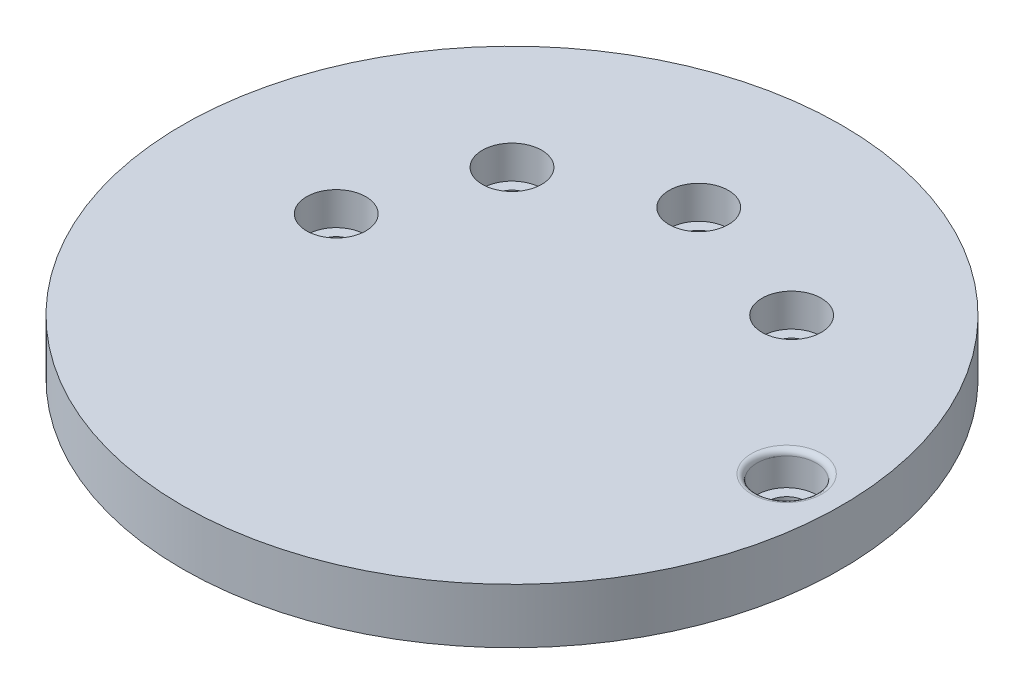
ISO-10303-21;
HEADER;
FILE_DESCRIPTION(('STEP AP214'),'2;1');
FILE_NAME('part.step','',(''),(''),'','','');
FILE_SCHEMA(('AUTOMOTIVE_DESIGN { 1 0 10303 214 1 1 1 1 }'));
ENDSEC;
DATA;
#1=APPLICATION_CONTEXT('core data for automotive mechanical design processes');
#2=APPLICATION_PROTOCOL_DEFINITION('international standard','automotive_design',2000,#1);
#3=PRODUCT_CONTEXT('',#1,'mechanical');
#4=PRODUCT('Part','Part','',(#3));
#5=PRODUCT_RELATED_PRODUCT_CATEGORY('part','',(#4));
#6=PRODUCT_DEFINITION_FORMATION('','',#4);
#7=PRODUCT_DEFINITION_CONTEXT('part definition',#1,'design');
#8=PRODUCT_DEFINITION('design','',#6,#7);
#9=PRODUCT_DEFINITION_SHAPE('','',#8);
#10=(LENGTH_UNIT() NAMED_UNIT(*) SI_UNIT(.MILLI.,.METRE.));
#11=(NAMED_UNIT(*) PLANE_ANGLE_UNIT() SI_UNIT($,.RADIAN.));
#12=(NAMED_UNIT(*) SI_UNIT($,.STERADIAN.) SOLID_ANGLE_UNIT());
#13=UNCERTAINTY_MEASURE_WITH_UNIT(LENGTH_MEASURE(1.E-05),#10,'distance_accuracy_value','');
#14=(GEOMETRIC_REPRESENTATION_CONTEXT(3) GLOBAL_UNCERTAINTY_ASSIGNED_CONTEXT((#13)) GLOBAL_UNIT_ASSIGNED_CONTEXT((#10,
#11,#12)) REPRESENTATION_CONTEXT('',''));
#15=CARTESIAN_POINT('',(0.,0.,0.));
#16=DIRECTION('',(0.,0.,1.));
#17=DIRECTION('',(1.,0.,0.));
#18=AXIS2_PLACEMENT_3D('',#15,#16,#17);
#19=CARTESIAN_POINT('',(0.,0.,0.));
#20=DIRECTION('',(0.,1.,0.));
#21=DIRECTION('',(0.,0.,1.));
#22=AXIS2_PLACEMENT_3D('',#19,#20,#21);
#23=PLANE('',#22);
#24=CARTESIAN_POINT('',(0.,0.,0.));
#25=DIRECTION('',(0.,1.,0.));
#26=DIRECTION('',(0.,0.,1.));
#27=AXIS2_PLACEMENT_3D('',#24,#25,#26);
#28=CIRCLE('',#27,10.16);
#29=CARTESIAN_POINT('',(0.,0.,10.16));
#30=VERTEX_POINT('',#29);
#31=EDGE_CURVE('E186',#30,#30,#28,.T.);
#32=ORIENTED_EDGE('',*,*,#31,.T.);
#33=EDGE_LOOP('',(#32));
#34=FACE_BOUND('',#33,.T.);
#35=CARTESIAN_POINT('',(0.,0.,0.));
#36=DIRECTION('',(0.,1.,0.));
#37=DIRECTION('',(0.,0.,1.));
#38=AXIS2_PLACEMENT_3D('',#35,#36,#37);
#39=CIRCLE('',#38,38.1);
#40=CARTESIAN_POINT('',(0.,0.,38.1));
#41=VERTEX_POINT('',#40);
#42=EDGE_CURVE('E81',#41,#41,#39,.T.);
#43=ORIENTED_EDGE('',*,*,#42,.F.);
#44=EDGE_LOOP('',(#43));
#45=FACE_BOUND('',#44,.T.);
#46=CARTESIAN_POINT('',(16.1644610179244,0.,-16.1644610179245));
#47=DIRECTION('',(0.,1.,0.));
#48=DIRECTION('',(0.,0.,1.));
#49=AXIS2_PLACEMENT_3D('',#46,#47,#48);
#50=CIRCLE('',#49,2.159);
#51=CARTESIAN_POINT('',(16.1644610179244,0.,-14.0054610179245));
#52=VERTEX_POINT('',#51);
#53=EDGE_CURVE('E99',#52,#52,#50,.T.);
#54=ORIENTED_EDGE('',*,*,#53,.T.);
#55=EDGE_LOOP('',(#54));
#56=FACE_BOUND('',#55,.T.);
#57=CARTESIAN_POINT('',(0.,0.,-21.59));
#58=DIRECTION('',(0.,1.,0.));
#59=DIRECTION('',(0.,0.,1.));
#60=AXIS2_PLACEMENT_3D('',#57,#58,#59);
#61=CIRCLE('',#60,2.159);
#62=CARTESIAN_POINT('',(0.,0.,-19.431));
#63=VERTEX_POINT('',#62);
#64=EDGE_CURVE('E113',#63,#63,#61,.T.);
#65=ORIENTED_EDGE('',*,*,#64,.T.);
#66=EDGE_LOOP('',(#65));
#67=FACE_BOUND('',#66,.T.);
#68=CARTESIAN_POINT('',(-14.8174225997642,0.,-14.817422599764));
#69=DIRECTION('',(0.,1.,0.));
#70=DIRECTION('',(0.,0.,1.));
#71=AXIS2_PLACEMENT_3D('',#68,#69,#70);
#72=CIRCLE('',#71,2.159);
#73=CARTESIAN_POINT('',(-14.8174225997642,0.,-12.658422599764));
#74=VERTEX_POINT('',#73);
#75=EDGE_CURVE('E109',#74,#74,#72,.T.);
#76=ORIENTED_EDGE('',*,*,#75,.T.);
#77=EDGE_LOOP('',(#76));
#78=FACE_BOUND('',#77,.T.);
#79=CARTESIAN_POINT('',(-20.32,0.,1.56790136429663E-13));
#80=DIRECTION('',(0.,1.,0.));
#81=DIRECTION('',(0.,0.,1.));
#82=AXIS2_PLACEMENT_3D('',#79,#80,#81);
#83=CIRCLE('',#82,2.159);
#84=CARTESIAN_POINT('',(-20.32,0.,2.15900000000016));
#85=VERTEX_POINT('',#84);
#86=EDGE_CURVE('E105',#85,#85,#83,.T.);
#87=ORIENTED_EDGE('',*,*,#86,.T.);
#88=EDGE_LOOP('',(#87));
#89=FACE_BOUND('',#88,.T.);
#90=CARTESIAN_POINT('',(31.75,0.,0.));
#91=DIRECTION('',(0.,1.,0.));
#92=DIRECTION('',(0.,0.,1.));
#93=AXIS2_PLACEMENT_3D('',#90,#91,#92);
#94=CIRCLE('',#93,2.159);
#95=CARTESIAN_POINT('',(31.75,0.,2.159));
#96=VERTEX_POINT('',#95);
#97=EDGE_CURVE('E100',#96,#96,#94,.T.);
#98=ORIENTED_EDGE('',*,*,#97,.T.);
#99=EDGE_LOOP('',(#98));
#100=FACE_BOUND('',#99,.T.);
#101=ADVANCED_FACE('F45',(#34,#45,#56,#67,#78,#89,#100),#23,.F.);
#102=CARTESIAN_POINT('',(0.,6.35,0.));
#103=DIRECTION('',(0.,1.,0.));
#104=DIRECTION('',(0.,0.,1.));
#105=AXIS2_PLACEMENT_3D('',#102,#103,#104);
#106=PLANE('',#105);
#107=CARTESIAN_POINT('',(31.75,6.35,0.));
#108=DIRECTION('',(0.,1.,0.));
#109=DIRECTION('',(0.,0.,1.));
#110=AXIS2_PLACEMENT_3D('',#107,#108,#109);
#111=CIRCLE('',#110,4.064);
#112=CARTESIAN_POINT('',(31.75,6.35,4.064));
#113=VERTEX_POINT('',#112);
#114=EDGE_CURVE('E54',#113,#113,#111,.F.);
#115=ORIENTED_EDGE('',*,*,#114,.T.);
#116=EDGE_LOOP('',(#115));
#117=FACE_BOUND('',#116,.T.);
#118=CARTESIAN_POINT('',(16.1644610179244,6.35,-16.1644610179245));
#119=DIRECTION('',(0.,1.,0.));
#120=DIRECTION('',(0.,0.,1.));
#121=AXIS2_PLACEMENT_3D('',#118,#119,#120);
#122=CIRCLE('',#121,3.429);
#123=CARTESIAN_POINT('',(16.1644610179244,6.35,-19.5934610179245));
#124=VERTEX_POINT('',#123);
#125=EDGE_CURVE('E143',#124,#124,#122,.F.);
#126=ORIENTED_EDGE('',*,*,#125,.T.);
#127=EDGE_LOOP('',(#126));
#128=FACE_BOUND('',#127,.T.);
#129=CARTESIAN_POINT('',(0.,6.35,-21.59));
#130=DIRECTION('',(0.,1.,0.));
#131=DIRECTION('',(0.,0.,1.));
#132=AXIS2_PLACEMENT_3D('',#129,#130,#131);
#133=CIRCLE('',#132,3.429);
#134=CARTESIAN_POINT('',(0.,6.35,-25.019));
#135=VERTEX_POINT('',#134);
#136=EDGE_CURVE('E159',#135,#135,#133,.F.);
#137=ORIENTED_EDGE('',*,*,#136,.T.);
#138=EDGE_LOOP('',(#137));
#139=FACE_BOUND('',#138,.T.);
#140=CARTESIAN_POINT('',(-20.32,6.35,1.56790136429663E-13));
#141=DIRECTION('',(0.,1.,0.));
#142=DIRECTION('',(0.,0.,1.));
#143=AXIS2_PLACEMENT_3D('',#140,#141,#142);
#144=CIRCLE('',#143,3.429);
#145=CARTESIAN_POINT('',(-20.32,6.35,-3.42899999999985));
#146=VERTEX_POINT('',#145);
#147=EDGE_CURVE('E155',#146,#146,#144,.F.);
#148=ORIENTED_EDGE('',*,*,#147,.T.);
#149=EDGE_LOOP('',(#148));
#150=FACE_BOUND('',#149,.T.);
#151=CARTESIAN_POINT('',(-14.8174225997642,6.35,-14.817422599764));
#152=DIRECTION('',(0.,1.,0.));
#153=DIRECTION('',(0.,0.,1.));
#154=AXIS2_PLACEMENT_3D('',#151,#152,#153);
#155=CIRCLE('',#154,3.429);
#156=CARTESIAN_POINT('',(-14.8174225997642,6.35,-18.246422599764));
#157=VERTEX_POINT('',#156);
#158=EDGE_CURVE('E124',#157,#157,#155,.F.);
#159=ORIENTED_EDGE('',*,*,#158,.T.);
#160=EDGE_LOOP('',(#159));
#161=FACE_BOUND('',#160,.T.);
#162=CARTESIAN_POINT('',(0.,6.35,0.));
#163=DIRECTION('',(0.,1.,0.));
#164=DIRECTION('',(0.,0.,1.));
#165=AXIS2_PLACEMENT_3D('',#162,#163,#164);
#166=CIRCLE('',#165,38.1);
#167=CARTESIAN_POINT('',(0.,6.35,38.1));
#168=VERTEX_POINT('',#167);
#169=EDGE_CURVE('E145',#168,#168,#166,.T.);
#170=ORIENTED_EDGE('',*,*,#169,.T.);
#171=EDGE_LOOP('',(#170));
#172=FACE_BOUND('',#171,.T.);
#173=ADVANCED_FACE('F193',(#117,#128,#139,#150,#161,#172),#106,.T.);
#174=CARTESIAN_POINT('',(0.,6.35,0.));
#175=DIRECTION('',(0.,-1.,0.));
#176=DIRECTION('',(0.,0.,-1.));
#177=AXIS2_PLACEMENT_3D('',#174,#175,#176);
#178=CYLINDRICAL_SURFACE('',#177,38.1);
#179=ORIENTED_EDGE('',*,*,#169,.F.);
#180=EDGE_LOOP('',(#179));
#181=FACE_BOUND('',#180,.T.);
#182=ORIENTED_EDGE('',*,*,#42,.T.);
#183=EDGE_LOOP('',(#182));
#184=FACE_BOUND('',#183,.T.);
#185=ADVANCED_FACE('F212',(#181,#184),#178,.T.);
#186=CARTESIAN_POINT('',(-14.8174225997642,6.350012,-14.817422599764));
#187=DIRECTION('',(0.,-1.,0.));
#188=DIRECTION('',(0.,0.,-1.));
#189=AXIS2_PLACEMENT_3D('',#186,#187,#188);
#190=CYLINDRICAL_SURFACE('',#189,3.429);
#191=CARTESIAN_POINT('',(-14.8174225997642,2.54,-14.817422599764));
#192=DIRECTION('',(0.,1.,0.));
#193=DIRECTION('',(0.,0.,1.));
#194=AXIS2_PLACEMENT_3D('',#191,#192,#193);
#195=CIRCLE('',#194,3.429);
#196=CARTESIAN_POINT('',(-14.8174225997642,2.54,-18.246422599764));
#197=VERTEX_POINT('',#196);
#198=EDGE_CURVE('E137',#197,#197,#195,.T.);
#199=CARTESIAN_POINT('',(-14.8174225997642,6.35,-18.246422599764));
#200=CARTESIAN_POINT('',(-14.8174225997642,6.3103125,-18.246422599764));
#201=CARTESIAN_POINT('',(-14.8174225997642,6.270625,-18.246422599764));
#202=CARTESIAN_POINT('',(-14.8174225997642,6.19125,-18.246422599764));
#203=CARTESIAN_POINT('',(-14.8174225997642,6.1515625,-18.246422599764));
#204=CARTESIAN_POINT('',(-14.8174225997642,6.0721875,-18.246422599764));
#205=CARTESIAN_POINT('',(-14.8174225997642,6.0325,-18.246422599764));
#206=CARTESIAN_POINT('',(-14.8174225997642,5.953125,-18.246422599764));
#207=CARTESIAN_POINT('',(-14.8174225997642,5.9134375,-18.246422599764));
#208=CARTESIAN_POINT('',(-14.8174225997642,5.8340625,-18.246422599764));
#209=CARTESIAN_POINT('',(-14.8174225997642,5.794375,-18.246422599764));
#210=CARTESIAN_POINT('',(-14.8174225997642,5.715,-18.246422599764));
#211=CARTESIAN_POINT('',(-14.8174225997642,5.6753125,-18.246422599764));
#212=CARTESIAN_POINT('',(-14.8174225997642,5.5959375,-18.246422599764));
#213=CARTESIAN_POINT('',(-14.8174225997642,5.55625,-18.246422599764));
#214=CARTESIAN_POINT('',(-14.8174225997642,5.476875,-18.246422599764));
#215=CARTESIAN_POINT('',(-14.8174225997642,5.4371875,-18.246422599764));
#216=CARTESIAN_POINT('',(-14.8174225997642,5.3578125,-18.246422599764));
#217=CARTESIAN_POINT('',(-14.8174225997642,5.318125,-18.246422599764));
#218=CARTESIAN_POINT('',(-14.8174225997642,5.23875,-18.246422599764));
#219=CARTESIAN_POINT('',(-14.8174225997642,5.1990625,-18.246422599764));
#220=CARTESIAN_POINT('',(-14.8174225997642,5.1196875,-18.246422599764));
#221=CARTESIAN_POINT('',(-14.8174225997642,5.08,-18.246422599764));
#222=CARTESIAN_POINT('',(-14.8174225997642,5.000625,-18.246422599764));
#223=CARTESIAN_POINT('',(-14.8174225997642,4.9609375,-18.246422599764));
#224=CARTESIAN_POINT('',(-14.8174225997642,4.8815625,-18.246422599764));
#225=CARTESIAN_POINT('',(-14.8174225997642,4.841875,-18.246422599764));
#226=CARTESIAN_POINT('',(-14.8174225997642,4.7625,-18.246422599764));
#227=CARTESIAN_POINT('',(-14.8174225997642,4.7228125,-18.246422599764));
#228=CARTESIAN_POINT('',(-14.8174225997642,4.6434375,-18.246422599764));
#229=CARTESIAN_POINT('',(-14.8174225997642,4.60375,-18.246422599764));
#230=CARTESIAN_POINT('',(-14.8174225997642,4.524375,-18.246422599764));
#231=CARTESIAN_POINT('',(-14.8174225997642,4.4846875,-18.246422599764));
#232=CARTESIAN_POINT('',(-14.8174225997642,4.4053125,-18.246422599764));
#233=CARTESIAN_POINT('',(-14.8174225997642,4.365625,-18.246422599764));
#234=CARTESIAN_POINT('',(-14.8174225997642,4.28625,-18.246422599764));
#235=CARTESIAN_POINT('',(-14.8174225997642,4.2465625,-18.246422599764));
#236=CARTESIAN_POINT('',(-14.8174225997642,4.1671875,-18.246422599764));
#237=CARTESIAN_POINT('',(-14.8174225997642,4.1275,-18.246422599764));
#238=CARTESIAN_POINT('',(-14.8174225997642,4.048125,-18.246422599764));
#239=CARTESIAN_POINT('',(-14.8174225997642,4.0084375,-18.246422599764));
#240=CARTESIAN_POINT('',(-14.8174225997642,3.9290625,-18.246422599764));
#241=CARTESIAN_POINT('',(-14.8174225997642,3.889375,-18.246422599764));
#242=CARTESIAN_POINT('',(-14.8174225997642,3.81,-18.246422599764));
#243=CARTESIAN_POINT('',(-14.8174225997642,3.7703125,-18.246422599764));
#244=CARTESIAN_POINT('',(-14.8174225997642,3.6909375,-18.246422599764));
#245=CARTESIAN_POINT('',(-14.8174225997642,3.65125,-18.246422599764));
#246=CARTESIAN_POINT('',(-14.8174225997642,3.571875,-18.246422599764));
#247=CARTESIAN_POINT('',(-14.8174225997642,3.5321875,-18.246422599764));
#248=CARTESIAN_POINT('',(-14.8174225997642,3.4528125,-18.246422599764));
#249=CARTESIAN_POINT('',(-14.8174225997642,3.413125,-18.246422599764));
#250=CARTESIAN_POINT('',(-14.8174225997642,3.33375,-18.246422599764));
#251=CARTESIAN_POINT('',(-14.8174225997642,3.2940625,-18.246422599764));
#252=CARTESIAN_POINT('',(-14.8174225997642,3.2146875,-18.246422599764));
#253=CARTESIAN_POINT('',(-14.8174225997642,3.175,-18.246422599764));
#254=CARTESIAN_POINT('',(-14.8174225997642,3.095625,-18.246422599764));
#255=CARTESIAN_POINT('',(-14.8174225997642,3.0559375,-18.246422599764));
#256=CARTESIAN_POINT('',(-14.8174225997642,2.9765625,-18.246422599764));
#257=CARTESIAN_POINT('',(-14.8174225997642,2.936875,-18.246422599764));
#258=CARTESIAN_POINT('',(-14.8174225997642,2.8575,-18.246422599764));
#259=CARTESIAN_POINT('',(-14.8174225997642,2.8178125,-18.246422599764));
#260=CARTESIAN_POINT('',(-14.8174225997642,2.7384375,-18.246422599764));
#261=CARTESIAN_POINT('',(-14.8174225997642,2.69875,-18.246422599764));
#262=CARTESIAN_POINT('',(-14.8174225997642,2.619375,-18.246422599764));
#263=CARTESIAN_POINT('',(-14.8174225997642,2.5796875,-18.246422599764));
#264=CARTESIAN_POINT('',(-14.8174225997642,2.54,-18.246422599764));
#265=B_SPLINE_CURVE_WITH_KNOTS('',3,(#199,#200,#201,#202,#203,#204,#205,#206,#207,#208,#209,
#210,#211,#212,#213,#214,#215,#216,#217,#218,#219,#220,#221,#222,#223,#224,#225,#226,#227,#228,
#229,#230,#231,#232,#233,#234,#235,#236,#237,#238,#239,#240,#241,#242,#243,#244,#245,#246,#247,
#248,#249,#250,#251,#252,#253,#254,#255,#256,#257,#258,#259,#260,#261,#262,#263,#264),
.UNSPECIFIED.,.F.,.F.,(4,2,2,2,2,2,2,2,2,2,2,2,2,2,2,2,2,2,2,2,2,2,2,2,2,2,2,2,2,2,2,2,4),(0.,
0.119062499999999,0.238125,0.3571875,0.476249999999999,0.595312499999999,0.714375,
0.833437499999999,0.952499999999999,1.0715625,1.190625,1.3096875,1.42875,1.5478125,1.666875,
1.7859375,1.905,2.0240625,2.143125,2.2621875,2.38125,2.5003125,2.619375,2.7384375,2.8575,
2.9765625,3.095625,3.2146875,3.33375,3.4528125,3.571875,3.6909375,3.81),.UNSPECIFIED.);
#266=EDGE_CURVE('BSEAM218',#157,#197,#265,.T.);
#267=ORIENTED_EDGE('',*,*,#158,.F.);
#268=ORIENTED_EDGE('',*,*,#198,.F.);
#269=ORIENTED_EDGE('',*,*,#266,.T.);
#270=ORIENTED_EDGE('',*,*,#266,.F.);
#271=EDGE_LOOP('',(#267,#269,#268,#270));
#272=FACE_BOUND('',#271,.T.);
#273=ADVANCED_FACE('F218',(#272),#190,.F.);
#274=CARTESIAN_POINT('',(0.,2.54,0.));
#275=DIRECTION('',(0.,1.,0.));
#276=DIRECTION('',(0.,0.,1.));
#277=AXIS2_PLACEMENT_3D('',#274,#275,#276);
#278=PLANE('',#277);
#279=CARTESIAN_POINT('',(-14.8174225997642,2.54,-14.817422599764));
#280=DIRECTION('',(0.,1.,0.));
#281=DIRECTION('',(0.,0.,1.));
#282=AXIS2_PLACEMENT_3D('',#279,#280,#281);
#283=CIRCLE('',#282,2.159);
#284=CARTESIAN_POINT('',(-14.8174225997642,2.54,-12.658422599764));
#285=VERTEX_POINT('',#284);
#286=EDGE_CURVE('E141',#285,#285,#283,.T.);
#287=ORIENTED_EDGE('',*,*,#286,.F.);
#288=EDGE_LOOP('',(#287));
#289=FACE_BOUND('',#288,.T.);
#290=ORIENTED_EDGE('',*,*,#198,.T.);
#291=EDGE_LOOP('',(#290));
#292=FACE_BOUND('',#291,.T.);
#293=ADVANCED_FACE('F223',(#289,#292),#278,.T.);
#294=CARTESIAN_POINT('',(-20.32,6.350012,1.56790136429663E-13));
#295=DIRECTION('',(0.,-1.,0.));
#296=DIRECTION('',(0.,0.,-1.));
#297=AXIS2_PLACEMENT_3D('',#294,#295,#296);
#298=CYLINDRICAL_SURFACE('',#297,3.429);
#299=CARTESIAN_POINT('',(-20.32,2.54,1.56790136429663E-13));
#300=DIRECTION('',(0.,1.,0.));
#301=DIRECTION('',(0.,0.,1.));
#302=AXIS2_PLACEMENT_3D('',#299,#300,#301);
#303=CIRCLE('',#302,3.429);
#304=CARTESIAN_POINT('',(-20.32,2.54,-3.42899999999985));
#305=VERTEX_POINT('',#304);
#306=EDGE_CURVE('E133',#305,#305,#303,.T.);
#307=CARTESIAN_POINT('',(-20.32,6.35,-3.42899999999985));
#308=CARTESIAN_POINT('',(-20.32,6.3103125,-3.42899999999985));
#309=CARTESIAN_POINT('',(-20.32,6.270625,-3.42899999999985));
#310=CARTESIAN_POINT('',(-20.32,6.19125,-3.42899999999985));
#311=CARTESIAN_POINT('',(-20.32,6.1515625,-3.42899999999985));
#312=CARTESIAN_POINT('',(-20.32,6.0721875,-3.42899999999985));
#313=CARTESIAN_POINT('',(-20.32,6.0325,-3.42899999999985));
#314=CARTESIAN_POINT('',(-20.32,5.953125,-3.42899999999985));
#315=CARTESIAN_POINT('',(-20.32,5.9134375,-3.42899999999985));
#316=CARTESIAN_POINT('',(-20.32,5.8340625,-3.42899999999985));
#317=CARTESIAN_POINT('',(-20.32,5.794375,-3.42899999999985));
#318=CARTESIAN_POINT('',(-20.32,5.715,-3.42899999999985));
#319=CARTESIAN_POINT('',(-20.32,5.6753125,-3.42899999999985));
#320=CARTESIAN_POINT('',(-20.32,5.5959375,-3.42899999999985));
#321=CARTESIAN_POINT('',(-20.32,5.55625,-3.42899999999985));
#322=CARTESIAN_POINT('',(-20.32,5.476875,-3.42899999999985));
#323=CARTESIAN_POINT('',(-20.32,5.4371875,-3.42899999999985));
#324=CARTESIAN_POINT('',(-20.32,5.3578125,-3.42899999999985));
#325=CARTESIAN_POINT('',(-20.32,5.318125,-3.42899999999985));
#326=CARTESIAN_POINT('',(-20.32,5.23875,-3.42899999999985));
#327=CARTESIAN_POINT('',(-20.32,5.1990625,-3.42899999999985));
#328=CARTESIAN_POINT('',(-20.32,5.1196875,-3.42899999999985));
#329=CARTESIAN_POINT('',(-20.32,5.08,-3.42899999999985));
#330=CARTESIAN_POINT('',(-20.32,5.000625,-3.42899999999985));
#331=CARTESIAN_POINT('',(-20.32,4.9609375,-3.42899999999985));
#332=CARTESIAN_POINT('',(-20.32,4.8815625,-3.42899999999985));
#333=CARTESIAN_POINT('',(-20.32,4.841875,-3.42899999999985));
#334=CARTESIAN_POINT('',(-20.32,4.7625,-3.42899999999985));
#335=CARTESIAN_POINT('',(-20.32,4.7228125,-3.42899999999985));
#336=CARTESIAN_POINT('',(-20.32,4.6434375,-3.42899999999985));
#337=CARTESIAN_POINT('',(-20.32,4.60375,-3.42899999999985));
#338=CARTESIAN_POINT('',(-20.32,4.524375,-3.42899999999985));
#339=CARTESIAN_POINT('',(-20.32,4.4846875,-3.42899999999985));
#340=CARTESIAN_POINT('',(-20.32,4.4053125,-3.42899999999985));
#341=CARTESIAN_POINT('',(-20.32,4.365625,-3.42899999999985));
#342=CARTESIAN_POINT('',(-20.32,4.28625,-3.42899999999985));
#343=CARTESIAN_POINT('',(-20.32,4.2465625,-3.42899999999985));
#344=CARTESIAN_POINT('',(-20.32,4.1671875,-3.42899999999985));
#345=CARTESIAN_POINT('',(-20.32,4.1275,-3.42899999999985));
#346=CARTESIAN_POINT('',(-20.32,4.048125,-3.42899999999985));
#347=CARTESIAN_POINT('',(-20.32,4.0084375,-3.42899999999985));
#348=CARTESIAN_POINT('',(-20.32,3.9290625,-3.42899999999985));
#349=CARTESIAN_POINT('',(-20.32,3.889375,-3.42899999999985));
#350=CARTESIAN_POINT('',(-20.32,3.81,-3.42899999999985));
#351=CARTESIAN_POINT('',(-20.32,3.7703125,-3.42899999999985));
#352=CARTESIAN_POINT('',(-20.32,3.6909375,-3.42899999999985));
#353=CARTESIAN_POINT('',(-20.32,3.65125,-3.42899999999985));
#354=CARTESIAN_POINT('',(-20.32,3.571875,-3.42899999999985));
#355=CARTESIAN_POINT('',(-20.32,3.5321875,-3.42899999999985));
#356=CARTESIAN_POINT('',(-20.32,3.4528125,-3.42899999999985));
#357=CARTESIAN_POINT('',(-20.32,3.413125,-3.42899999999985));
#358=CARTESIAN_POINT('',(-20.32,3.33375,-3.42899999999985));
#359=CARTESIAN_POINT('',(-20.32,3.2940625,-3.42899999999985));
#360=CARTESIAN_POINT('',(-20.32,3.2146875,-3.42899999999985));
#361=CARTESIAN_POINT('',(-20.32,3.175,-3.42899999999985));
#362=CARTESIAN_POINT('',(-20.32,3.095625,-3.42899999999985));
#363=CARTESIAN_POINT('',(-20.32,3.0559375,-3.42899999999985));
#364=CARTESIAN_POINT('',(-20.32,2.9765625,-3.42899999999985));
#365=CARTESIAN_POINT('',(-20.32,2.936875,-3.42899999999985));
#366=CARTESIAN_POINT('',(-20.32,2.8575,-3.42899999999985));
#367=CARTESIAN_POINT('',(-20.32,2.8178125,-3.42899999999985));
#368=CARTESIAN_POINT('',(-20.32,2.7384375,-3.42899999999985));
#369=CARTESIAN_POINT('',(-20.32,2.69875,-3.42899999999985));
#370=CARTESIAN_POINT('',(-20.32,2.619375,-3.42899999999985));
#371=CARTESIAN_POINT('',(-20.32,2.5796875,-3.42899999999985));
#372=CARTESIAN_POINT('',(-20.32,2.54,-3.42899999999985));
#373=B_SPLINE_CURVE_WITH_KNOTS('',3,(#307,#308,#309,#310,#311,#312,#313,#314,#315,#316,#317,
#318,#319,#320,#321,#322,#323,#324,#325,#326,#327,#328,#329,#330,#331,#332,#333,#334,#335,#336,
#337,#338,#339,#340,#341,#342,#343,#344,#345,#346,#347,#348,#349,#350,#351,#352,#353,#354,#355,
#356,#357,#358,#359,#360,#361,#362,#363,#364,#365,#366,#367,#368,#369,#370,#371,#372),
.UNSPECIFIED.,.F.,.F.,(4,2,2,2,2,2,2,2,2,2,2,2,2,2,2,2,2,2,2,2,2,2,2,2,2,2,2,2,2,2,2,2,4),(0.,
0.119062499999999,0.238125,0.3571875,0.476249999999999,0.595312499999999,0.714375,
0.833437499999999,0.952499999999999,1.0715625,1.190625,1.3096875,1.42875,1.5478125,1.666875,
1.7859375,1.905,2.0240625,2.143125,2.2621875,2.38125,2.5003125,2.619375,2.7384375,2.8575,
2.9765625,3.095625,3.2146875,3.33375,3.4528125,3.571875,3.6909375,3.81),.UNSPECIFIED.);
#374=EDGE_CURVE('BSEAM292',#146,#305,#373,.T.);
#375=ORIENTED_EDGE('',*,*,#147,.F.);
#376=ORIENTED_EDGE('',*,*,#306,.F.);
#377=ORIENTED_EDGE('',*,*,#374,.T.);
#378=ORIENTED_EDGE('',*,*,#374,.F.);
#379=EDGE_LOOP('',(#375,#377,#376,#378));
#380=FACE_BOUND('',#379,.T.);
#381=ADVANCED_FACE('F292',(#380),#298,.F.);
#382=CARTESIAN_POINT('',(0.,2.54,0.));
#383=DIRECTION('',(0.,1.,0.));
#384=DIRECTION('',(0.,0.,1.));
#385=AXIS2_PLACEMENT_3D('',#382,#383,#384);
#386=PLANE('',#385);
#387=CARTESIAN_POINT('',(-20.32,2.54,1.56790136429663E-13));
#388=DIRECTION('',(0.,1.,0.));
#389=DIRECTION('',(0.,0.,1.));
#390=AXIS2_PLACEMENT_3D('',#387,#388,#389);
#391=CIRCLE('',#390,2.159);
#392=CARTESIAN_POINT('',(-20.32,2.54,2.15900000000016));
#393=VERTEX_POINT('',#392);
#394=EDGE_CURVE('E177',#393,#393,#391,.T.);
#395=ORIENTED_EDGE('',*,*,#394,.F.);
#396=EDGE_LOOP('',(#395));
#397=FACE_BOUND('',#396,.T.);
#398=ORIENTED_EDGE('',*,*,#306,.T.);
#399=EDGE_LOOP('',(#398));
#400=FACE_BOUND('',#399,.T.);
#401=ADVANCED_FACE('F288',(#397,#400),#386,.T.);
#402=CARTESIAN_POINT('',(0.,6.350012,-21.59));
#403=DIRECTION('',(0.,-1.,0.));
#404=DIRECTION('',(0.,0.,-1.));
#405=AXIS2_PLACEMENT_3D('',#402,#403,#404);
#406=CYLINDRICAL_SURFACE('',#405,3.429);
#407=CARTESIAN_POINT('',(0.,2.54,-21.59));
#408=DIRECTION('',(0.,1.,0.));
#409=DIRECTION('',(0.,0.,1.));
#410=AXIS2_PLACEMENT_3D('',#407,#408,#409);
#411=CIRCLE('',#410,3.429);
#412=CARTESIAN_POINT('',(0.,2.54,-25.019));
#413=VERTEX_POINT('',#412);
#414=EDGE_CURVE('E129',#413,#413,#411,.T.);
#415=CARTESIAN_POINT('',(0.,6.35,-25.019));
#416=CARTESIAN_POINT('',(0.,6.3103125,-25.019));
#417=CARTESIAN_POINT('',(0.,6.270625,-25.019));
#418=CARTESIAN_POINT('',(0.,6.19125,-25.019));
#419=CARTESIAN_POINT('',(0.,6.1515625,-25.019));
#420=CARTESIAN_POINT('',(0.,6.0721875,-25.019));
#421=CARTESIAN_POINT('',(0.,6.0325,-25.019));
#422=CARTESIAN_POINT('',(0.,5.953125,-25.019));
#423=CARTESIAN_POINT('',(0.,5.9134375,-25.019));
#424=CARTESIAN_POINT('',(0.,5.8340625,-25.019));
#425=CARTESIAN_POINT('',(0.,5.794375,-25.019));
#426=CARTESIAN_POINT('',(0.,5.715,-25.019));
#427=CARTESIAN_POINT('',(0.,5.6753125,-25.019));
#428=CARTESIAN_POINT('',(0.,5.5959375,-25.019));
#429=CARTESIAN_POINT('',(0.,5.55625,-25.019));
#430=CARTESIAN_POINT('',(0.,5.476875,-25.019));
#431=CARTESIAN_POINT('',(0.,5.4371875,-25.019));
#432=CARTESIAN_POINT('',(0.,5.3578125,-25.019));
#433=CARTESIAN_POINT('',(0.,5.318125,-25.019));
#434=CARTESIAN_POINT('',(0.,5.23875,-25.019));
#435=CARTESIAN_POINT('',(0.,5.1990625,-25.019));
#436=CARTESIAN_POINT('',(0.,5.1196875,-25.019));
#437=CARTESIAN_POINT('',(0.,5.08,-25.019));
#438=CARTESIAN_POINT('',(0.,5.000625,-25.019));
#439=CARTESIAN_POINT('',(0.,4.9609375,-25.019));
#440=CARTESIAN_POINT('',(0.,4.8815625,-25.019));
#441=CARTESIAN_POINT('',(0.,4.841875,-25.019));
#442=CARTESIAN_POINT('',(0.,4.7625,-25.019));
#443=CARTESIAN_POINT('',(0.,4.7228125,-25.019));
#444=CARTESIAN_POINT('',(0.,4.6434375,-25.019));
#445=CARTESIAN_POINT('',(0.,4.60375,-25.019));
#446=CARTESIAN_POINT('',(0.,4.524375,-25.019));
#447=CARTESIAN_POINT('',(0.,4.4846875,-25.019));
#448=CARTESIAN_POINT('',(0.,4.4053125,-25.019));
#449=CARTESIAN_POINT('',(0.,4.365625,-25.019));
#450=CARTESIAN_POINT('',(0.,4.28625,-25.019));
#451=CARTESIAN_POINT('',(0.,4.2465625,-25.019));
#452=CARTESIAN_POINT('',(0.,4.1671875,-25.019));
#453=CARTESIAN_POINT('',(0.,4.1275,-25.019));
#454=CARTESIAN_POINT('',(0.,4.048125,-25.019));
#455=CARTESIAN_POINT('',(0.,4.0084375,-25.019));
#456=CARTESIAN_POINT('',(0.,3.9290625,-25.019));
#457=CARTESIAN_POINT('',(0.,3.889375,-25.019));
#458=CARTESIAN_POINT('',(0.,3.81,-25.019));
#459=CARTESIAN_POINT('',(0.,3.7703125,-25.019));
#460=CARTESIAN_POINT('',(0.,3.6909375,-25.019));
#461=CARTESIAN_POINT('',(0.,3.65125,-25.019));
#462=CARTESIAN_POINT('',(0.,3.571875,-25.019));
#463=CARTESIAN_POINT('',(0.,3.5321875,-25.019));
#464=CARTESIAN_POINT('',(0.,3.4528125,-25.019));
#465=CARTESIAN_POINT('',(0.,3.413125,-25.019));
#466=CARTESIAN_POINT('',(0.,3.33375,-25.019));
#467=CARTESIAN_POINT('',(0.,3.2940625,-25.019));
#468=CARTESIAN_POINT('',(0.,3.2146875,-25.019));
#469=CARTESIAN_POINT('',(0.,3.175,-25.019));
#470=CARTESIAN_POINT('',(0.,3.095625,-25.019));
#471=CARTESIAN_POINT('',(0.,3.0559375,-25.019));
#472=CARTESIAN_POINT('',(0.,2.9765625,-25.019));
#473=CARTESIAN_POINT('',(0.,2.936875,-25.019));
#474=CARTESIAN_POINT('',(0.,2.8575,-25.019));
#475=CARTESIAN_POINT('',(0.,2.8178125,-25.019));
#476=CARTESIAN_POINT('',(0.,2.7384375,-25.019));
#477=CARTESIAN_POINT('',(0.,2.69875,-25.019));
#478=CARTESIAN_POINT('',(0.,2.619375,-25.019));
#479=CARTESIAN_POINT('',(0.,2.5796875,-25.019));
#480=CARTESIAN_POINT('',(0.,2.54,-25.019));
#481=B_SPLINE_CURVE_WITH_KNOTS('',3,(#415,#416,#417,#418,#419,#420,#421,#422,#423,#424,#425,
#426,#427,#428,#429,#430,#431,#432,#433,#434,#435,#436,#437,#438,#439,#440,#441,#442,#443,#444,
#445,#446,#447,#448,#449,#450,#451,#452,#453,#454,#455,#456,#457,#458,#459,#460,#461,#462,#463,
#464,#465,#466,#467,#468,#469,#470,#471,#472,#473,#474,#475,#476,#477,#478,#479,#480),
.UNSPECIFIED.,.F.,.F.,(4,2,2,2,2,2,2,2,2,2,2,2,2,2,2,2,2,2,2,2,2,2,2,2,2,2,2,2,2,2,2,2,4),(0.,
0.119062499999999,0.238125,0.3571875,0.476249999999999,0.595312499999999,0.714375,
0.833437499999999,0.952499999999999,1.0715625,1.190625,1.3096875,1.42875,1.5478125,1.666875,
1.7859375,1.905,2.0240625,2.143125,2.2621875,2.38125,2.5003125,2.619375,2.7384375,2.8575,
2.9765625,3.095625,3.2146875,3.33375,3.4528125,3.571875,3.6909375,3.81),.UNSPECIFIED.);
#482=EDGE_CURVE('BSEAM284',#135,#413,#481,.T.);
#483=ORIENTED_EDGE('',*,*,#136,.F.);
#484=ORIENTED_EDGE('',*,*,#414,.F.);
#485=ORIENTED_EDGE('',*,*,#482,.T.);
#486=ORIENTED_EDGE('',*,*,#482,.F.);
#487=EDGE_LOOP('',(#483,#485,#484,#486));
#488=FACE_BOUND('',#487,.T.);
#489=ADVANCED_FACE('F284',(#488),#406,.F.);
#490=CARTESIAN_POINT('',(0.,2.54,0.));
#491=DIRECTION('',(0.,1.,0.));
#492=DIRECTION('',(0.,0.,1.));
#493=AXIS2_PLACEMENT_3D('',#490,#491,#492);
#494=PLANE('',#493);
#495=CARTESIAN_POINT('',(0.,2.54,-21.59));
#496=DIRECTION('',(0.,1.,0.));
#497=DIRECTION('',(0.,0.,1.));
#498=AXIS2_PLACEMENT_3D('',#495,#496,#497);
#499=CIRCLE('',#498,2.159);
#500=CARTESIAN_POINT('',(0.,2.54,-19.431));
#501=VERTEX_POINT('',#500);
#502=EDGE_CURVE('E173',#501,#501,#499,.T.);
#503=ORIENTED_EDGE('',*,*,#502,.F.);
#504=EDGE_LOOP('',(#503));
#505=FACE_BOUND('',#504,.T.);
#506=ORIENTED_EDGE('',*,*,#414,.T.);
#507=EDGE_LOOP('',(#506));
#508=FACE_BOUND('',#507,.T.);
#509=ADVANCED_FACE('F280',(#505,#508),#494,.T.);
#510=CARTESIAN_POINT('',(16.1644610179244,6.350012,-16.1644610179245));
#511=DIRECTION('',(0.,-1.,0.));
#512=DIRECTION('',(0.,0.,-1.));
#513=AXIS2_PLACEMENT_3D('',#510,#511,#512);
#514=CYLINDRICAL_SURFACE('',#513,3.429);
#515=CARTESIAN_POINT('',(16.1644610179244,2.54,-16.1644610179245));
#516=DIRECTION('',(0.,1.,0.));
#517=DIRECTION('',(0.,0.,1.));
#518=AXIS2_PLACEMENT_3D('',#515,#516,#517);
#519=CIRCLE('',#518,3.429);
#520=CARTESIAN_POINT('',(16.1644610179244,2.54,-19.5934610179245));
#521=VERTEX_POINT('',#520);
#522=EDGE_CURVE('E125',#521,#521,#519,.T.);
#523=CARTESIAN_POINT('',(16.1644610179244,6.35,-19.5934610179245));
#524=CARTESIAN_POINT('',(16.1644610179244,6.3103125,-19.5934610179245));
#525=CARTESIAN_POINT('',(16.1644610179244,6.270625,-19.5934610179245));
#526=CARTESIAN_POINT('',(16.1644610179244,6.19125,-19.5934610179245));
#527=CARTESIAN_POINT('',(16.1644610179244,6.1515625,-19.5934610179245));
#528=CARTESIAN_POINT('',(16.1644610179244,6.0721875,-19.5934610179245));
#529=CARTESIAN_POINT('',(16.1644610179244,6.0325,-19.5934610179245));
#530=CARTESIAN_POINT('',(16.1644610179244,5.953125,-19.5934610179245));
#531=CARTESIAN_POINT('',(16.1644610179244,5.9134375,-19.5934610179245));
#532=CARTESIAN_POINT('',(16.1644610179244,5.8340625,-19.5934610179245));
#533=CARTESIAN_POINT('',(16.1644610179244,5.794375,-19.5934610179245));
#534=CARTESIAN_POINT('',(16.1644610179244,5.715,-19.5934610179245));
#535=CARTESIAN_POINT('',(16.1644610179244,5.6753125,-19.5934610179245));
#536=CARTESIAN_POINT('',(16.1644610179244,5.5959375,-19.5934610179245));
#537=CARTESIAN_POINT('',(16.1644610179244,5.55625,-19.5934610179245));
#538=CARTESIAN_POINT('',(16.1644610179244,5.476875,-19.5934610179245));
#539=CARTESIAN_POINT('',(16.1644610179244,5.4371875,-19.5934610179245));
#540=CARTESIAN_POINT('',(16.1644610179244,5.3578125,-19.5934610179245));
#541=CARTESIAN_POINT('',(16.1644610179244,5.318125,-19.5934610179245));
#542=CARTESIAN_POINT('',(16.1644610179244,5.23875,-19.5934610179245));
#543=CARTESIAN_POINT('',(16.1644610179244,5.1990625,-19.5934610179245));
#544=CARTESIAN_POINT('',(16.1644610179244,5.1196875,-19.5934610179245));
#545=CARTESIAN_POINT('',(16.1644610179244,5.08,-19.5934610179245));
#546=CARTESIAN_POINT('',(16.1644610179244,5.000625,-19.5934610179245));
#547=CARTESIAN_POINT('',(16.1644610179244,4.9609375,-19.5934610179245));
#548=CARTESIAN_POINT('',(16.1644610179244,4.8815625,-19.5934610179245));
#549=CARTESIAN_POINT('',(16.1644610179244,4.841875,-19.5934610179245));
#550=CARTESIAN_POINT('',(16.1644610179244,4.7625,-19.5934610179245));
#551=CARTESIAN_POINT('',(16.1644610179244,4.7228125,-19.5934610179245));
#552=CARTESIAN_POINT('',(16.1644610179244,4.6434375,-19.5934610179245));
#553=CARTESIAN_POINT('',(16.1644610179244,4.60375,-19.5934610179245));
#554=CARTESIAN_POINT('',(16.1644610179244,4.524375,-19.5934610179245));
#555=CARTESIAN_POINT('',(16.1644610179244,4.4846875,-19.5934610179245));
#556=CARTESIAN_POINT('',(16.1644610179244,4.4053125,-19.5934610179245));
#557=CARTESIAN_POINT('',(16.1644610179244,4.365625,-19.5934610179245));
#558=CARTESIAN_POINT('',(16.1644610179244,4.28625,-19.5934610179245));
#559=CARTESIAN_POINT('',(16.1644610179244,4.2465625,-19.5934610179245));
#560=CARTESIAN_POINT('',(16.1644610179244,4.1671875,-19.5934610179245));
#561=CARTESIAN_POINT('',(16.1644610179244,4.1275,-19.5934610179245));
#562=CARTESIAN_POINT('',(16.1644610179244,4.048125,-19.5934610179245));
#563=CARTESIAN_POINT('',(16.1644610179244,4.0084375,-19.5934610179245));
#564=CARTESIAN_POINT('',(16.1644610179244,3.9290625,-19.5934610179245));
#565=CARTESIAN_POINT('',(16.1644610179244,3.889375,-19.5934610179245));
#566=CARTESIAN_POINT('',(16.1644610179244,3.81,-19.5934610179245));
#567=CARTESIAN_POINT('',(16.1644610179244,3.7703125,-19.5934610179245));
#568=CARTESIAN_POINT('',(16.1644610179244,3.6909375,-19.5934610179245));
#569=CARTESIAN_POINT('',(16.1644610179244,3.65125,-19.5934610179245));
#570=CARTESIAN_POINT('',(16.1644610179244,3.571875,-19.5934610179245));
#571=CARTESIAN_POINT('',(16.1644610179244,3.5321875,-19.5934610179245));
#572=CARTESIAN_POINT('',(16.1644610179244,3.4528125,-19.5934610179245));
#573=CARTESIAN_POINT('',(16.1644610179244,3.413125,-19.5934610179245));
#574=CARTESIAN_POINT('',(16.1644610179244,3.33375,-19.5934610179245));
#575=CARTESIAN_POINT('',(16.1644610179244,3.2940625,-19.5934610179245));
#576=CARTESIAN_POINT('',(16.1644610179244,3.2146875,-19.5934610179245));
#577=CARTESIAN_POINT('',(16.1644610179244,3.175,-19.5934610179245));
#578=CARTESIAN_POINT('',(16.1644610179244,3.095625,-19.5934610179245));
#579=CARTESIAN_POINT('',(16.1644610179244,3.0559375,-19.5934610179245));
#580=CARTESIAN_POINT('',(16.1644610179244,2.9765625,-19.5934610179245));
#581=CARTESIAN_POINT('',(16.1644610179244,2.936875,-19.5934610179245));
#582=CARTESIAN_POINT('',(16.1644610179244,2.8575,-19.5934610179245));
#583=CARTESIAN_POINT('',(16.1644610179244,2.8178125,-19.5934610179245));
#584=CARTESIAN_POINT('',(16.1644610179244,2.7384375,-19.5934610179245));
#585=CARTESIAN_POINT('',(16.1644610179244,2.69875,-19.5934610179245));
#586=CARTESIAN_POINT('',(16.1644610179244,2.619375,-19.5934610179245));
#587=CARTESIAN_POINT('',(16.1644610179244,2.5796875,-19.5934610179245));
#588=CARTESIAN_POINT('',(16.1644610179244,2.54,-19.5934610179245));
#589=B_SPLINE_CURVE_WITH_KNOTS('',3,(#523,#524,#525,#526,#527,#528,#529,#530,#531,#532,#533,
#534,#535,#536,#537,#538,#539,#540,#541,#542,#543,#544,#545,#546,#547,#548,#549,#550,#551,#552,
#553,#554,#555,#556,#557,#558,#559,#560,#561,#562,#563,#564,#565,#566,#567,#568,#569,#570,#571,
#572,#573,#574,#575,#576,#577,#578,#579,#580,#581,#582,#583,#584,#585,#586,#587,#588),
.UNSPECIFIED.,.F.,.F.,(4,2,2,2,2,2,2,2,2,2,2,2,2,2,2,2,2,2,2,2,2,2,2,2,2,2,2,2,2,2,2,2,4),(0.,
0.119062499999999,0.238125,0.3571875,0.476249999999999,0.595312499999999,0.714375,
0.833437499999999,0.952499999999999,1.0715625,1.190625,1.3096875,1.42875,1.5478125,1.666875,
1.7859375,1.905,2.0240625,2.143125,2.2621875,2.38125,2.5003125,2.619375,2.7384375,2.8575,
2.9765625,3.095625,3.2146875,3.33375,3.4528125,3.571875,3.6909375,3.81),.UNSPECIFIED.);
#590=EDGE_CURVE('BSEAM276',#124,#521,#589,.T.);
#591=ORIENTED_EDGE('',*,*,#125,.F.);
#592=ORIENTED_EDGE('',*,*,#522,.F.);
#593=ORIENTED_EDGE('',*,*,#590,.T.);
#594=ORIENTED_EDGE('',*,*,#590,.F.);
#595=EDGE_LOOP('',(#591,#593,#592,#594));
#596=FACE_BOUND('',#595,.T.);
#597=ADVANCED_FACE('F276',(#596),#514,.F.);
#598=CARTESIAN_POINT('',(0.,2.54,0.));
#599=DIRECTION('',(0.,1.,0.));
#600=DIRECTION('',(0.,0.,1.));
#601=AXIS2_PLACEMENT_3D('',#598,#599,#600);
#602=PLANE('',#601);
#603=CARTESIAN_POINT('',(16.1644610179244,2.54,-16.1644610179245));
#604=DIRECTION('',(0.,1.,0.));
#605=DIRECTION('',(0.,0.,1.));
#606=AXIS2_PLACEMENT_3D('',#603,#604,#605);
#607=CIRCLE('',#606,2.159);
#608=CARTESIAN_POINT('',(16.1644610179244,2.54,-14.0054610179245));
#609=VERTEX_POINT('',#608);
#610=EDGE_CURVE('E169',#609,#609,#607,.T.);
#611=ORIENTED_EDGE('',*,*,#610,.F.);
#612=EDGE_LOOP('',(#611));
#613=FACE_BOUND('',#612,.T.);
#614=ORIENTED_EDGE('',*,*,#522,.T.);
#615=EDGE_LOOP('',(#614));
#616=FACE_BOUND('',#615,.T.);
#617=ADVANCED_FACE('F272',(#613,#616),#602,.T.);
#618=CARTESIAN_POINT('',(31.75,6.350012,0.));
#619=DIRECTION('',(0.,-1.,0.));
#620=DIRECTION('',(0.,0.,-1.));
#621=AXIS2_PLACEMENT_3D('',#618,#619,#620);
#622=CYLINDRICAL_SURFACE('',#621,3.429);
#623=CARTESIAN_POINT('',(31.75,5.715,0.));
#624=DIRECTION('',(0.,1.,0.));
#625=DIRECTION('',(0.,0.,1.));
#626=AXIS2_PLACEMENT_3D('',#623,#624,#625);
#627=CIRCLE('',#626,3.429);
#628=CARTESIAN_POINT('',(31.75,5.715,-3.429));
#629=VERTEX_POINT('',#628);
#630=EDGE_CURVE('E11',#629,#629,#627,.T.);
#631=CARTESIAN_POINT('',(31.75,2.54,0.));
#632=DIRECTION('',(0.,1.,0.));
#633=DIRECTION('',(0.,0.,1.));
#634=AXIS2_PLACEMENT_3D('',#631,#632,#633);
#635=CIRCLE('',#634,3.429);
#636=CARTESIAN_POINT('',(31.75,2.54,-3.429));
#637=VERTEX_POINT('',#636);
#638=EDGE_CURVE('E120',#637,#637,#635,.T.);
#639=CARTESIAN_POINT('',(31.75,5.715,-3.429));
#640=CARTESIAN_POINT('',(31.75,5.68192708333333,-3.429));
#641=CARTESIAN_POINT('',(31.75,5.64885416666667,-3.429));
#642=CARTESIAN_POINT('',(31.75,5.58270833333333,-3.429));
#643=CARTESIAN_POINT('',(31.75,5.54963541666667,-3.429));
#644=CARTESIAN_POINT('',(31.75,5.48348958333333,-3.429));
#645=CARTESIAN_POINT('',(31.75,5.45041666666667,-3.429));
#646=CARTESIAN_POINT('',(31.75,5.38427083333333,-3.429));
#647=CARTESIAN_POINT('',(31.75,5.35119791666667,-3.429));
#648=CARTESIAN_POINT('',(31.75,5.28505208333333,-3.429));
#649=CARTESIAN_POINT('',(31.75,5.25197916666667,-3.429));
#650=CARTESIAN_POINT('',(31.75,5.18583333333333,-3.429));
#651=CARTESIAN_POINT('',(31.75,5.15276041666667,-3.429));
#652=CARTESIAN_POINT('',(31.75,5.08661458333333,-3.429));
#653=CARTESIAN_POINT('',(31.75,5.05354166666667,-3.429));
#654=CARTESIAN_POINT('',(31.75,4.98739583333333,-3.429));
#655=CARTESIAN_POINT('',(31.75,4.95432291666667,-3.429));
#656=CARTESIAN_POINT('',(31.75,4.88817708333333,-3.429));
#657=CARTESIAN_POINT('',(31.75,4.85510416666667,-3.429));
#658=CARTESIAN_POINT('',(31.75,4.78895833333333,-3.429));
#659=CARTESIAN_POINT('',(31.75,4.75588541666667,-3.429));
#660=CARTESIAN_POINT('',(31.75,4.68973958333333,-3.429));
#661=CARTESIAN_POINT('',(31.75,4.65666666666667,-3.429));
#662=CARTESIAN_POINT('',(31.75,4.59052083333333,-3.429));
#663=CARTESIAN_POINT('',(31.75,4.55744791666667,-3.429));
#664=CARTESIAN_POINT('',(31.75,4.49130208333333,-3.429));
#665=CARTESIAN_POINT('',(31.75,4.45822916666667,-3.429));
#666=CARTESIAN_POINT('',(31.75,4.39208333333333,-3.429));
#667=CARTESIAN_POINT('',(31.75,4.35901041666667,-3.429));
#668=CARTESIAN_POINT('',(31.75,4.29286458333333,-3.429));
#669=CARTESIAN_POINT('',(31.75,4.25979166666667,-3.429));
#670=CARTESIAN_POINT('',(31.75,4.19364583333333,-3.429));
#671=CARTESIAN_POINT('',(31.75,4.16057291666667,-3.429));
#672=CARTESIAN_POINT('',(31.75,4.09442708333333,-3.429));
#673=CARTESIAN_POINT('',(31.75,4.06135416666667,-3.429));
#674=CARTESIAN_POINT('',(31.75,3.99520833333333,-3.429));
#675=CARTESIAN_POINT('',(31.75,3.96213541666667,-3.429));
#676=CARTESIAN_POINT('',(31.75,3.89598958333333,-3.429));
#677=CARTESIAN_POINT('',(31.75,3.86291666666667,-3.429));
#678=CARTESIAN_POINT('',(31.75,3.79677083333333,-3.429));
#679=CARTESIAN_POINT('',(31.75,3.76369791666667,-3.429));
#680=CARTESIAN_POINT('',(31.75,3.69755208333333,-3.429));
#681=CARTESIAN_POINT('',(31.75,3.66447916666667,-3.429));
#682=CARTESIAN_POINT('',(31.75,3.59833333333333,-3.429));
#683=CARTESIAN_POINT('',(31.75,3.56526041666667,-3.429));
#684=CARTESIAN_POINT('',(31.75,3.49911458333333,-3.429));
#685=CARTESIAN_POINT('',(31.75,3.46604166666667,-3.429));
#686=CARTESIAN_POINT('',(31.75,3.39989583333333,-3.429));
#687=CARTESIAN_POINT('',(31.75,3.36682291666667,-3.429));
#688=CARTESIAN_POINT('',(31.75,3.30067708333333,-3.429));
#689=CARTESIAN_POINT('',(31.75,3.26760416666667,-3.429));
#690=CARTESIAN_POINT('',(31.75,3.20145833333333,-3.429));
#691=CARTESIAN_POINT('',(31.75,3.16838541666667,-3.429));
#692=CARTESIAN_POINT('',(31.75,3.10223958333333,-3.429));
#693=CARTESIAN_POINT('',(31.75,3.06916666666667,-3.429));
#694=CARTESIAN_POINT('',(31.75,3.00302083333333,-3.429));
#695=CARTESIAN_POINT('',(31.75,2.96994791666667,-3.429));
#696=CARTESIAN_POINT('',(31.75,2.90380208333333,-3.429));
#697=CARTESIAN_POINT('',(31.75,2.87072916666667,-3.429));
#698=CARTESIAN_POINT('',(31.75,2.80458333333333,-3.429));
#699=CARTESIAN_POINT('',(31.75,2.77151041666667,-3.429));
#700=CARTESIAN_POINT('',(31.75,2.70536458333333,-3.429));
#701=CARTESIAN_POINT('',(31.75,2.67229166666667,-3.429));
#702=CARTESIAN_POINT('',(31.75,2.60614583333333,-3.429));
#703=CARTESIAN_POINT('',(31.75,2.57307291666667,-3.429));
#704=CARTESIAN_POINT('',(31.75,2.54,-3.429));
#705=B_SPLINE_CURVE_WITH_KNOTS('',3,(#639,#640,#641,#642,#643,#644,#645,#646,#647,#648,#649,
#650,#651,#652,#653,#654,#655,#656,#657,#658,#659,#660,#661,#662,#663,#664,#665,#666,#667,#668,
#669,#670,#671,#672,#673,#674,#675,#676,#677,#678,#679,#680,#681,#682,#683,#684,#685,#686,#687,
#688,#689,#690,#691,#692,#693,#694,#695,#696,#697,#698,#699,#700,#701,#702,#703,#704),
.UNSPECIFIED.,.F.,.F.,(4,2,2,2,2,2,2,2,2,2,2,2,2,2,2,2,2,2,2,2,2,2,2,2,2,2,2,2,2,2,2,2,4),(0.,
0.0992187499999995,0.1984375,0.297656249999999,0.396875,0.496093749999999,0.595312499999999,
0.694531249999999,0.793749999999999,0.89296875,0.992187499999999,1.09140625,1.190625,1.28984375,
1.3890625,1.48828125,1.5875,1.68671875,1.7859375,1.88515625,1.984375,2.08359375,2.1828125,
2.28203125,2.38125,2.48046875,2.5796875,2.67890625,2.778125,2.87734375,2.9765625,3.07578125,
3.175),.UNSPECIFIED.);
#706=EDGE_CURVE('BSEAM253',#629,#637,#705,.T.);
#707=ORIENTED_EDGE('',*,*,#630,.T.);
#708=ORIENTED_EDGE('',*,*,#638,.F.);
#709=ORIENTED_EDGE('',*,*,#706,.T.);
#710=ORIENTED_EDGE('',*,*,#706,.F.);
#711=EDGE_LOOP('',(#707,#709,#708,#710));
#712=FACE_BOUND('',#711,.T.);
#713=ADVANCED_FACE('F253',(#712),#622,.F.);
#714=CARTESIAN_POINT('',(0.,2.54,0.));
#715=DIRECTION('',(0.,1.,0.));
#716=DIRECTION('',(0.,0.,1.));
#717=AXIS2_PLACEMENT_3D('',#714,#715,#716);
#718=PLANE('',#717);
#719=CARTESIAN_POINT('',(31.75,2.54,0.));
#720=DIRECTION('',(0.,1.,0.));
#721=DIRECTION('',(0.,0.,1.));
#722=AXIS2_PLACEMENT_3D('',#719,#720,#721);
#723=CIRCLE('',#722,2.159);
#724=CARTESIAN_POINT('',(31.75,2.54,2.159));
#725=VERTEX_POINT('',#724);
#726=EDGE_CURVE('E104',#725,#725,#723,.T.);
#727=ORIENTED_EDGE('',*,*,#726,.F.);
#728=EDGE_LOOP('',(#727));
#729=FACE_BOUND('',#728,.T.);
#730=ORIENTED_EDGE('',*,*,#638,.T.);
#731=EDGE_LOOP('',(#730));
#732=FACE_BOUND('',#731,.T.);
#733=ADVANCED_FACE('F243',(#729,#732),#718,.T.);
#734=CARTESIAN_POINT('',(31.75,0.,0.));
#735=DIRECTION('',(0.,1.,0.));
#736=DIRECTION('',(0.,0.,1.));
#737=AXIS2_PLACEMENT_3D('',#734,#735,#736);
#738=CYLINDRICAL_SURFACE('',#737,2.159);
#739=ORIENTED_EDGE('',*,*,#726,.T.);
#740=EDGE_LOOP('',(#739));
#741=FACE_BOUND('',#740,.T.);
#742=ORIENTED_EDGE('',*,*,#97,.F.);
#743=EDGE_LOOP('',(#742));
#744=FACE_BOUND('',#743,.T.);
#745=ADVANCED_FACE('F240',(#741,#744),#738,.F.);
#746=CARTESIAN_POINT('',(16.1644610179244,0.,-16.1644610179245));
#747=DIRECTION('',(0.,1.,0.));
#748=DIRECTION('',(0.,0.,1.));
#749=AXIS2_PLACEMENT_3D('',#746,#747,#748);
#750=CYLINDRICAL_SURFACE('',#749,2.159);
#751=ORIENTED_EDGE('',*,*,#610,.T.);
#752=EDGE_LOOP('',(#751));
#753=FACE_BOUND('',#752,.T.);
#754=ORIENTED_EDGE('',*,*,#53,.F.);
#755=EDGE_LOOP('',(#754));
#756=FACE_BOUND('',#755,.T.);
#757=ADVANCED_FACE('F242',(#753,#756),#750,.F.);
#758=CARTESIAN_POINT('',(0.,0.,-21.59));
#759=DIRECTION('',(0.,1.,0.));
#760=DIRECTION('',(0.,0.,1.));
#761=AXIS2_PLACEMENT_3D('',#758,#759,#760);
#762=CYLINDRICAL_SURFACE('',#761,2.159);
#763=ORIENTED_EDGE('',*,*,#502,.T.);
#764=EDGE_LOOP('',(#763));
#765=FACE_BOUND('',#764,.T.);
#766=ORIENTED_EDGE('',*,*,#64,.F.);
#767=EDGE_LOOP('',(#766));
#768=FACE_BOUND('',#767,.T.);
#769=ADVANCED_FACE('F250',(#765,#768),#762,.F.);
#770=CARTESIAN_POINT('',(-20.32,0.,1.56790136429663E-13));
#771=DIRECTION('',(0.,1.,0.));
#772=DIRECTION('',(0.,0.,1.));
#773=AXIS2_PLACEMENT_3D('',#770,#771,#772);
#774=CYLINDRICAL_SURFACE('',#773,2.159);
#775=ORIENTED_EDGE('',*,*,#394,.T.);
#776=EDGE_LOOP('',(#775));
#777=FACE_BOUND('',#776,.T.);
#778=ORIENTED_EDGE('',*,*,#86,.F.);
#779=EDGE_LOOP('',(#778));
#780=FACE_BOUND('',#779,.T.);
#781=ADVANCED_FACE('F260',(#777,#780),#774,.F.);
#782=CARTESIAN_POINT('',(-14.8174225997642,0.,-14.817422599764));
#783=DIRECTION('',(0.,1.,0.));
#784=DIRECTION('',(0.,0.,1.));
#785=AXIS2_PLACEMENT_3D('',#782,#783,#784);
#786=CYLINDRICAL_SURFACE('',#785,2.159);
#787=ORIENTED_EDGE('',*,*,#286,.T.);
#788=EDGE_LOOP('',(#787));
#789=FACE_BOUND('',#788,.T.);
#790=ORIENTED_EDGE('',*,*,#75,.F.);
#791=EDGE_LOOP('',(#790));
#792=FACE_BOUND('',#791,.T.);
#793=ADVANCED_FACE('F263',(#789,#792),#786,.F.);
#794=CARTESIAN_POINT('',(0.,-3.81,0.));
#795=DIRECTION('',(0.,-1.,0.));
#796=DIRECTION('',(0.,0.,-1.));
#797=AXIS2_PLACEMENT_3D('',#794,#795,#796);
#798=PLANE('',#797);
#799=CARTESIAN_POINT('',(0.,-3.81,0.));
#800=DIRECTION('',(0.,-1.,0.));
#801=DIRECTION('',(0.,0.,-1.));
#802=AXIS2_PLACEMENT_3D('',#799,#800,#801);
#803=CIRCLE('',#802,6.35);
#804=CARTESIAN_POINT('',(0.,-3.81,-6.35));
#805=VERTEX_POINT('',#804);
#806=EDGE_CURVE('E88',#805,#805,#803,.T.);
#807=ORIENTED_EDGE('',*,*,#806,.T.);
#808=EDGE_LOOP('',(#807));
#809=FACE_BOUND('',#808,.T.);
#810=DIRECTION('',(1.,0.,0.));
#811=VECTOR('',#810,1.);
#812=CARTESIAN_POINT('',(-1.786407019,-3.81,-2.48749995675227));
#813=LINE('',#812,#811);
#814=CARTESIAN_POINT('',(-1.786407019,-3.81,-2.48749995675227));
#815=VERTEX_POINT('',#814);
#816=CARTESIAN_POINT('',(1.786407019,-3.81,-2.48749995675227));
#817=VERTEX_POINT('',#816);
#818=EDGE_CURVE('E84',#815,#817,#813,.T.);
#819=ORIENTED_EDGE('',*,*,#818,.F.);
#820=CARTESIAN_POINT('',(0.,-3.81,0.));
#821=DIRECTION('',(0.,-1.,0.));
#822=DIRECTION('',(0.,0.,-1.));
#823=AXIS2_PLACEMENT_3D('',#820,#821,#822);
#824=CIRCLE('',#823,3.062499971);
#825=EDGE_CURVE('E77',#817,#815,#824,.T.);
#826=ORIENTED_EDGE('',*,*,#825,.F.);
#827=EDGE_LOOP('',(#819,#826));
#828=FACE_BOUND('',#827,.T.);
#829=ADVANCED_FACE('F90',(#809,#828),#798,.T.);
#830=CARTESIAN_POINT('',(0.,5.08,0.));
#831=DIRECTION('',(0.,1.,0.));
#832=DIRECTION('',(0.,0.,1.));
#833=AXIS2_PLACEMENT_3D('',#830,#831,#832);
#834=PLANE('',#833);
#835=CARTESIAN_POINT('',(0.,5.08,0.));
#836=DIRECTION('',(0.,1.,0.));
#837=DIRECTION('',(0.,0.,1.));
#838=AXIS2_PLACEMENT_3D('',#835,#836,#837);
#839=CIRCLE('',#838,3.062499971);
#840=CARTESIAN_POINT('',(-1.786407019,5.08,-2.48749995675227));
#841=VERTEX_POINT('',#840);
#842=CARTESIAN_POINT('',(1.786407019,5.08,-2.48749995675227));
#843=VERTEX_POINT('',#842);
#844=EDGE_CURVE('E60',#841,#843,#839,.T.);
#845=ORIENTED_EDGE('',*,*,#844,.F.);
#846=DIRECTION('',(-1.,0.,0.));
#847=VECTOR('',#846,1.);
#848=CARTESIAN_POINT('',(-1.786407019,5.08,-2.48749995675227));
#849=LINE('',#848,#847);
#850=EDGE_CURVE('E63',#843,#841,#849,.T.);
#851=ORIENTED_EDGE('',*,*,#850,.F.);
#852=EDGE_LOOP('',(#845,#851));
#853=FACE_BOUND('',#852,.T.);
#854=ADVANCED_FACE('F258',(#853),#834,.F.);
#855=CARTESIAN_POINT('',(-1.786407019,6.35,-2.48749995675227));
#856=DIRECTION('',(0.,0.,1.));
#857=DIRECTION('',(1.,0.,0.));
#858=AXIS2_PLACEMENT_3D('',#855,#856,#857);
#859=PLANE('',#858);
#860=DIRECTION('',(0.,-1.,0.));
#861=VECTOR('',#860,1.);
#862=CARTESIAN_POINT('',(1.786407019,6.35,-2.48749995675227));
#863=LINE('',#862,#861);
#864=EDGE_CURVE('E72',#843,#817,#863,.T.);
#865=ORIENTED_EDGE('',*,*,#864,.F.);
#866=ORIENTED_EDGE('',*,*,#850,.T.);
#867=DIRECTION('',(0.,-1.,0.));
#868=VECTOR('',#867,1.);
#869=CARTESIAN_POINT('',(-1.786407019,6.35,-2.48749995675227));
#870=LINE('',#869,#868);
#871=EDGE_CURVE('E82',#841,#815,#870,.T.);
#872=ORIENTED_EDGE('',*,*,#871,.T.);
#873=ORIENTED_EDGE('',*,*,#818,.T.);
#874=EDGE_LOOP('',(#865,#866,#872,#873));
#875=FACE_BOUND('',#874,.T.);
#876=ADVANCED_FACE('F85',(#875),#859,.T.);
#877=CARTESIAN_POINT('',(0.,6.35,0.));
#878=DIRECTION('',(0.,-1.,0.));
#879=DIRECTION('',(0.,0.,-1.));
#880=AXIS2_PLACEMENT_3D('',#877,#878,#879);
#881=CYLINDRICAL_SURFACE('',#880,3.062499971);
#882=ORIENTED_EDGE('',*,*,#871,.F.);
#883=ORIENTED_EDGE('',*,*,#844,.T.);
#884=ORIENTED_EDGE('',*,*,#864,.T.);
#885=ORIENTED_EDGE('',*,*,#825,.T.);
#886=EDGE_LOOP('',(#882,#883,#884,#885));
#887=FACE_BOUND('',#886,.T.);
#888=ADVANCED_FACE('F75',(#887),#881,.F.);
#889=CARTESIAN_POINT('',(0.,-3.81,0.));
#890=DIRECTION('',(0.,1.,0.));
#891=DIRECTION('',(0.,0.,1.));
#892=AXIS2_PLACEMENT_3D('',#889,#890,#891);
#893=TOROIDAL_SURFACE('',#892,10.16,3.81);
#894=ORIENTED_EDGE('',*,*,#31,.F.);
#895=EDGE_LOOP('',(#894));
#896=FACE_BOUND('',#895,.T.);
#897=ORIENTED_EDGE('',*,*,#806,.F.);
#898=EDGE_LOOP('',(#897));
#899=FACE_BOUND('',#898,.T.);
#900=ADVANCED_FACE('F197',(#896,#899),#893,.F.);
#901=CARTESIAN_POINT('',(31.75,5.715,0.));
#902=DIRECTION('',(0.,1.,0.));
#903=DIRECTION('',(0.,0.,1.));
#904=AXIS2_PLACEMENT_3D('',#901,#902,#903);
#905=TOROIDAL_SURFACE('',#904,4.064,0.635);
#906=ORIENTED_EDGE('',*,*,#630,.F.);
#907=EDGE_LOOP('',(#906));
#908=FACE_BOUND('',#907,.T.);
#909=ORIENTED_EDGE('',*,*,#114,.F.);
#910=EDGE_LOOP('',(#909));
#911=FACE_BOUND('',#910,.T.);
#912=ADVANCED_FACE('F47',(#908,#911),#905,.T.);
#913=CLOSED_SHELL('',(#101,#173,#185,#273,#293,#381,#401,#489,#509,#597,#617,#713,#733,#745,
#757,#769,#781,#793,#829,#854,#876,#888,#900,#912));
#914=MANIFOLD_SOLID_BREP('B2',#913);
#915=ADVANCED_BREP_SHAPE_REPRESENTATION('',(#18,#914),#14);
#916=SHAPE_DEFINITION_REPRESENTATION(#9,#915);
ENDSEC;
END-ISO-10303-21;
